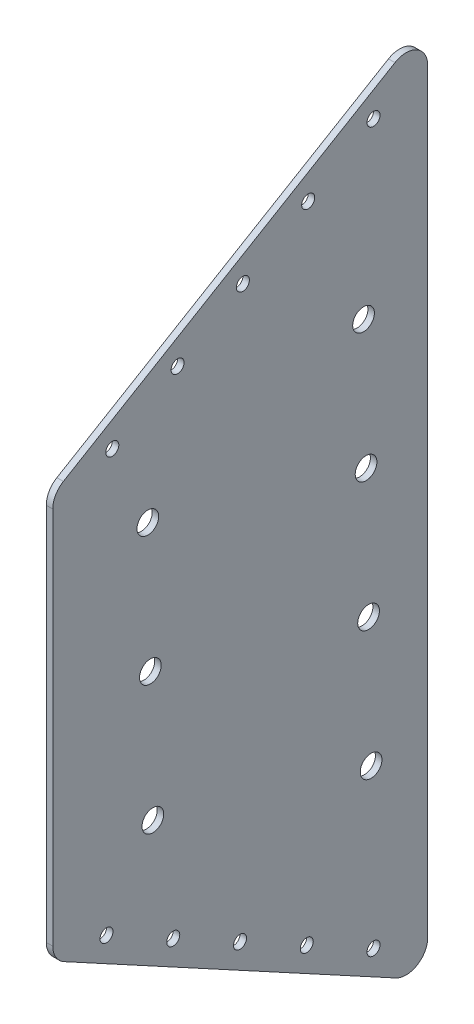
ISO-10303-21;
HEADER;
FILE_DESCRIPTION(('STEP AP214'),'2;1');
FILE_NAME('part.step','',(''),(''),'','','');
FILE_SCHEMA(('AUTOMOTIVE_DESIGN { 1 0 10303 214 1 1 1 1 }'));
ENDSEC;
DATA;
#1=APPLICATION_CONTEXT('core data for automotive mechanical design processes');
#2=APPLICATION_PROTOCOL_DEFINITION('international standard','automotive_design',2000,#1);
#3=PRODUCT_CONTEXT('',#1,'mechanical');
#4=PRODUCT('Part','Part','',(#3));
#5=PRODUCT_RELATED_PRODUCT_CATEGORY('part','',(#4));
#6=PRODUCT_DEFINITION_FORMATION('','',#4);
#7=PRODUCT_DEFINITION_CONTEXT('part definition',#1,'design');
#8=PRODUCT_DEFINITION('design','',#6,#7);
#9=PRODUCT_DEFINITION_SHAPE('','',#8);
#10=(LENGTH_UNIT() NAMED_UNIT(*) SI_UNIT(.MILLI.,.METRE.));
#11=(NAMED_UNIT(*) PLANE_ANGLE_UNIT() SI_UNIT($,.RADIAN.));
#12=(NAMED_UNIT(*) SI_UNIT($,.STERADIAN.) SOLID_ANGLE_UNIT());
#13=UNCERTAINTY_MEASURE_WITH_UNIT(LENGTH_MEASURE(1.E-05),#10,'distance_accuracy_value','');
#14=(GEOMETRIC_REPRESENTATION_CONTEXT(3) GLOBAL_UNCERTAINTY_ASSIGNED_CONTEXT((#13)) GLOBAL_UNIT_ASSIGNED_CONTEXT((#10,
#11,#12)) REPRESENTATION_CONTEXT('',''));
#15=CARTESIAN_POINT('',(0.,0.,0.));
#16=DIRECTION('',(0.,0.,1.));
#17=DIRECTION('',(1.,0.,0.));
#18=AXIS2_PLACEMENT_3D('',#15,#16,#17);
#19=CARTESIAN_POINT('',(3.,317.945389167895,-631.946459814717));
#20=DIRECTION('',(0.,0.8789083603278,-0.476990664631812));
#21=DIRECTION('',(0.,0.476990664631812,0.8789083603278));
#22=AXIS2_PLACEMENT_3D('',#19,#20,#21);
#23=PLANE('',#22);
#24=DIRECTION('',(0.,-0.476990664631812,-0.8789083603278));
#25=VECTOR('',#24,1.);
#26=CARTESIAN_POINT('',(3.,317.945389167895,-631.946459814717));
#27=LINE('',#26,#25);
#28=CARTESIAN_POINT('',(3.,408.895308586337,-464.36111595959));
#29=VERTEX_POINT('',#28);
#30=CARTESIAN_POINT('',(3.,325.961136776838,-617.176553168399));
#31=VERTEX_POINT('',#30);
#32=EDGE_CURVE('E127',#29,#31,#27,.T.);
#33=ORIENTED_EDGE('',*,*,#32,.F.);
#34=DIRECTION('',(-1.,0.,0.));
#35=VECTOR('',#34,1.);
#36=CARTESIAN_POINT('',(3.,408.895308586337,-464.361115959591));
#37=LINE('',#36,#35);
#38=CARTESIAN_POINT('',(0.,408.895308586337,-464.36111595959));
#39=VERTEX_POINT('',#38);
#40=EDGE_CURVE('E153',#29,#39,#37,.T.);
#41=ORIENTED_EDGE('',*,*,#40,.T.);
#42=DIRECTION('',(0.,-0.476990664631812,-0.8789083603278));
#43=VECTOR('',#42,1.);
#44=CARTESIAN_POINT('',(0.,317.945389167895,-631.946459814717));
#45=LINE('',#44,#43);
#46=CARTESIAN_POINT('',(0.,325.961136776838,-617.176553168399));
#47=VERTEX_POINT('',#46);
#48=EDGE_CURVE('E159',#39,#47,#45,.T.);
#49=ORIENTED_EDGE('',*,*,#48,.T.);
#50=DIRECTION('',(-1.,0.,0.));
#51=VECTOR('',#50,1.);
#52=CARTESIAN_POINT('',(3.,325.961136776838,-617.176553168399));
#53=LINE('',#52,#51);
#54=EDGE_CURVE('E151',#47,#31,#53,.F.);
#55=ORIENTED_EDGE('',*,*,#54,.T.);
#56=EDGE_LOOP('',(#33,#41,#49,#55));
#57=FACE_BOUND('',#56,.T.);
#58=ADVANCED_FACE('F35',(#57),#23,.F.);
#59=CARTESIAN_POINT('',(3.,700.452034156903,-631.946459814717));
#60=DIRECTION('',(0.,0.,1.));
#61=DIRECTION('',(1.,0.,0.));
#62=AXIS2_PLACEMENT_3D('',#59,#60,#61);
#63=PLANE('',#62);
#64=DIRECTION('',(0.,1.,0.));
#65=VECTOR('',#64,1.);
#66=CARTESIAN_POINT('',(3.,700.452034156903,-631.946459814717));
#67=LINE('',#66,#65);
#68=CARTESIAN_POINT('',(3.,334.750220380116,-631.946459814717));
#69=VERTEX_POINT('',#68);
#70=CARTESIAN_POINT('',(3.,682.885243210379,-631.946459814717));
#71=VERTEX_POINT('',#70);
#72=EDGE_CURVE('E130',#69,#71,#67,.T.);
#73=ORIENTED_EDGE('',*,*,#72,.F.);
#74=DIRECTION('',(-1.,0.,0.));
#75=VECTOR('',#74,1.);
#76=CARTESIAN_POINT('',(3.,334.750220380116,-631.946459814717));
#77=LINE('',#76,#75);
#78=CARTESIAN_POINT('',(0.,334.750220380116,-631.946459814717));
#79=VERTEX_POINT('',#78);
#80=EDGE_CURVE('E11',#69,#79,#77,.T.);
#81=ORIENTED_EDGE('',*,*,#80,.T.);
#82=DIRECTION('',(0.,1.,0.));
#83=VECTOR('',#82,1.);
#84=CARTESIAN_POINT('',(0.,700.452034156903,-631.946459814717));
#85=LINE('',#84,#83);
#86=CARTESIAN_POINT('',(0.,682.885243210379,-631.946459814717));
#87=VERTEX_POINT('',#86);
#88=EDGE_CURVE('E132',#79,#87,#85,.T.);
#89=ORIENTED_EDGE('',*,*,#88,.T.);
#90=DIRECTION('',(-1.,0.,0.));
#91=VECTOR('',#90,1.);
#92=CARTESIAN_POINT('',(3.,682.885243210379,-631.946459814717));
#93=LINE('',#92,#91);
#94=EDGE_CURVE('E43',#87,#71,#93,.F.);
#95=ORIENTED_EDGE('',*,*,#94,.T.);
#96=EDGE_LOOP('',(#73,#81,#89,#95));
#97=FACE_BOUND('',#96,.T.);
#98=ADVANCED_FACE('F317',(#97),#63,.F.);
#99=CARTESIAN_POINT('',(3.,597.849507887663,-459.131022605909));
#100=DIRECTION('',(0.,-0.859869246027072,-0.510514328630289));
#101=DIRECTION('',(0.,0.510514328630289,-0.859869246027072));
#102=AXIS2_PLACEMENT_3D('',#99,#100,#101);
#103=PLANE('',#102);
#104=DIRECTION('',(0.,-0.510514328630289,0.859869246027072));
#105=VECTOR('',#104,1.);
#106=CARTESIAN_POINT('',(0.,597.849507887663,-459.131022605909));
#107=LINE('',#106,#105);
#108=CARTESIAN_POINT('',(0.,691.48393567065,-616.841316528414));
#109=VERTEX_POINT('',#108);
#110=CARTESIAN_POINT('',(0.,600.755641000901,-464.025879319606));
#111=VERTEX_POINT('',#110);
#112=EDGE_CURVE('E128',#109,#111,#107,.T.);
#113=ORIENTED_EDGE('',*,*,#112,.T.);
#114=DIRECTION('',(-1.,0.,0.));
#115=VECTOR('',#114,1.);
#116=CARTESIAN_POINT('',(3.,600.755641000901,-464.025879319606));
#117=LINE('',#116,#115);
#118=CARTESIAN_POINT('',(3.,600.755641000901,-464.025879319606));
#119=VERTEX_POINT('',#118);
#120=EDGE_CURVE('E106',#111,#119,#117,.F.);
#121=ORIENTED_EDGE('',*,*,#120,.T.);
#122=DIRECTION('',(0.,-0.510514328630289,0.859869246027072));
#123=VECTOR('',#122,1.);
#124=CARTESIAN_POINT('',(3.,597.849507887663,-459.131022605909));
#125=LINE('',#124,#123);
#126=CARTESIAN_POINT('',(3.,691.48393567065,-616.841316528414));
#127=VERTEX_POINT('',#126);
#128=EDGE_CURVE('E171',#127,#119,#125,.T.);
#129=ORIENTED_EDGE('',*,*,#128,.F.);
#130=DIRECTION('',(-1.,0.,0.));
#131=VECTOR('',#130,1.);
#132=CARTESIAN_POINT('',(3.,691.48393567065,-616.841316528414));
#133=LINE('',#132,#131);
#134=EDGE_CURVE('E111',#127,#109,#133,.T.);
#135=ORIENTED_EDGE('',*,*,#134,.T.);
#136=EDGE_LOOP('',(#113,#121,#129,#135));
#137=FACE_BOUND('',#136,.T.);
#138=ADVANCED_FACE('F315',(#137),#103,.F.);
#139=CARTESIAN_POINT('',(3.,411.73372248415,-459.131022605909));
#140=DIRECTION('',(0.,0.,-1.));
#141=DIRECTION('',(-1.,0.,0.));
#142=AXIS2_PLACEMENT_3D('',#139,#140,#141);
#143=PLANE('',#142);
#144=DIRECTION('',(0.,-1.,0.));
#145=VECTOR('',#144,1.);
#146=CARTESIAN_POINT('',(3.,411.73372248415,-459.131022605909));
#147=LINE('',#146,#145);
#148=CARTESIAN_POINT('',(3.,592.15694854063,-459.131022605909));
#149=VERTEX_POINT('',#148);
#150=CARTESIAN_POINT('',(3.,417.684392189615,-459.131022605909));
#151=VERTEX_POINT('',#150);
#152=EDGE_CURVE('E121',#149,#151,#147,.T.);
#153=ORIENTED_EDGE('',*,*,#152,.F.);
#154=DIRECTION('',(-1.,0.,0.));
#155=VECTOR('',#154,1.);
#156=CARTESIAN_POINT('',(3.,592.15694854063,-459.131022605909));
#157=LINE('',#156,#155);
#158=CARTESIAN_POINT('',(0.,592.15694854063,-459.131022605909));
#159=VERTEX_POINT('',#158);
#160=EDGE_CURVE('E105',#149,#159,#157,.T.);
#161=ORIENTED_EDGE('',*,*,#160,.T.);
#162=DIRECTION('',(0.,-1.,0.));
#163=VECTOR('',#162,1.);
#164=CARTESIAN_POINT('',(0.,411.73372248415,-459.131022605909));
#165=LINE('',#164,#163);
#166=CARTESIAN_POINT('',(0.,417.684392189615,-459.131022605909));
#167=VERTEX_POINT('',#166);
#168=EDGE_CURVE('E118',#159,#167,#165,.T.);
#169=ORIENTED_EDGE('',*,*,#168,.T.);
#170=DIRECTION('',(-1.,0.,0.));
#171=VECTOR('',#170,1.);
#172=CARTESIAN_POINT('',(3.,417.684392189615,-459.131022605909));
#173=LINE('',#172,#171);
#174=EDGE_CURVE('E123',#167,#151,#173,.F.);
#175=ORIENTED_EDGE('',*,*,#174,.T.);
#176=EDGE_LOOP('',(#153,#161,#169,#175));
#177=FACE_BOUND('',#176,.T.);
#178=ADVANCED_FACE('F117',(#177),#143,.F.);
#179=CARTESIAN_POINT('',(3.,0.,0.));
#180=DIRECTION('',(-1.,0.,0.));
#181=DIRECTION('',(0.,0.,1.));
#182=AXIS2_PLACEMENT_3D('',#179,#180,#181);
#183=PLANE('',#182);
#184=CARTESIAN_POINT('',(3.,536.299523654884,-603.522472038288));
#185=DIRECTION('',(1.,0.,0.));
#186=DIRECTION('',(0.,0.,-1.));
#187=AXIS2_PLACEMENT_3D('',#184,#185,#186);
#188=CIRCLE('',#187,5.00000000000005);
#189=CARTESIAN_POINT('',(3.,536.299523654884,-608.522472038288));
#190=VERTEX_POINT('',#189);
#191=EDGE_CURVE('E235',#190,#190,#188,.T.);
#192=ORIENTED_EDGE('',*,*,#191,.F.);
#193=EDGE_LOOP('',(#192));
#194=FACE_BOUND('',#193,.T.);
#195=CARTESIAN_POINT('',(3.,476.310683396387,-604.679642916149));
#196=DIRECTION('',(1.,0.,0.));
#197=DIRECTION('',(0.,0.,-1.));
#198=AXIS2_PLACEMENT_3D('',#195,#196,#197);
#199=CIRCLE('',#198,5.00000000000005);
#200=CARTESIAN_POINT('',(3.,476.310683396387,-609.679642916149));
#201=VERTEX_POINT('',#200);
#202=EDGE_CURVE('E265',#201,#201,#199,.T.);
#203=ORIENTED_EDGE('',*,*,#202,.F.);
#204=EDGE_LOOP('',(#203));
#205=FACE_BOUND('',#204,.T.);
#206=CARTESIAN_POINT('',(3.,416.32184313789,-605.836813794009));
#207=DIRECTION('',(1.,0.,0.));
#208=DIRECTION('',(0.,0.,-1.));
#209=AXIS2_PLACEMENT_3D('',#206,#207,#208);
#210=CIRCLE('',#209,5.00000000000005);
#211=CARTESIAN_POINT('',(3.,416.32184313789,-610.836813794009));
#212=VERTEX_POINT('',#211);
#213=EDGE_CURVE('E259',#212,#212,#210,.T.);
#214=ORIENTED_EDGE('',*,*,#213,.F.);
#215=EDGE_LOOP('',(#214));
#216=FACE_BOUND('',#215,.T.);
#217=CARTESIAN_POINT('',(3.,564.856704632131,-502.953007581503));
#218=DIRECTION('',(1.,0.,0.));
#219=DIRECTION('',(0.,0.,-1.));
#220=AXIS2_PLACEMENT_3D('',#217,#218,#219);
#221=CIRCLE('',#220,5.00000000000005);
#222=CARTESIAN_POINT('',(3.,564.856704632131,-507.953007581503));
#223=VERTEX_POINT('',#222);
#224=EDGE_CURVE('E253',#223,#223,#221,.T.);
#225=ORIENTED_EDGE('',*,*,#224,.F.);
#226=EDGE_LOOP('',(#225));
#227=FACE_BOUND('',#226,.T.);
#228=CARTESIAN_POINT('',(3.,504.867864373634,-504.110178459364));
#229=DIRECTION('',(1.,0.,0.));
#230=DIRECTION('',(0.,0.,-1.));
#231=AXIS2_PLACEMENT_3D('',#228,#229,#230);
#232=CIRCLE('',#231,5.00000000000005);
#233=CARTESIAN_POINT('',(3.,504.867864373634,-509.110178459364));
#234=VERTEX_POINT('',#233);
#235=EDGE_CURVE('E247',#234,#234,#232,.T.);
#236=ORIENTED_EDGE('',*,*,#235,.F.);
#237=EDGE_LOOP('',(#236));
#238=FACE_BOUND('',#237,.T.);
#239=CARTESIAN_POINT('',(3.,444.879024115137,-505.267349337224));
#240=DIRECTION('',(1.,0.,0.));
#241=DIRECTION('',(0.,0.,-1.));
#242=AXIS2_PLACEMENT_3D('',#239,#240,#241);
#243=CIRCLE('',#242,4.99999999999992);
#244=CARTESIAN_POINT('',(3.,444.879024115137,-510.267349337224));
#245=VERTEX_POINT('',#244);
#246=EDGE_CURVE('E241',#245,#245,#243,.T.);
#247=ORIENTED_EDGE('',*,*,#246,.F.);
#248=EDGE_LOOP('',(#247));
#249=FACE_BOUND('',#248,.T.);
#250=CARTESIAN_POINT('',(3.,596.288363913381,-602.365301160428));
#251=DIRECTION('',(1.,0.,0.));
#252=DIRECTION('',(0.,0.,-1.));
#253=AXIS2_PLACEMENT_3D('',#250,#251,#252);
#254=CIRCLE('',#253,4.99999999999994);
#255=CARTESIAN_POINT('',(3.,596.288363913381,-607.365301160428));
#256=VERTEX_POINT('',#255);
#257=EDGE_CURVE('E218',#256,#256,#254,.T.);
#258=ORIENTED_EDGE('',*,*,#257,.F.);
#259=EDGE_LOOP('',(#258));
#260=FACE_BOUND('',#259,.T.);
#261=CARTESIAN_POINT('',(3.,359.585514772297,-576.184667203244));
#262=DIRECTION('',(1.,0.,0.));
#263=DIRECTION('',(0.,0.,-1.));
#264=AXIS2_PLACEMENT_3D('',#261,#262,#263);
#265=CIRCLE('',#264,3.00000000000005);
#266=CARTESIAN_POINT('',(3.,359.585514772297,-579.184667203244));
#267=VERTEX_POINT('',#266);
#268=EDGE_CURVE('E182',#267,#267,#265,.T.);
#269=ORIENTED_EDGE('',*,*,#268,.F.);
#270=EDGE_LOOP('',(#269));
#271=FACE_BOUND('',#270,.T.);
#272=CARTESIAN_POINT('',(3.,602.50756350252,-486.564765370927));
#273=DIRECTION('',(1.,0.,0.));
#274=DIRECTION('',(0.,0.,-1.));
#275=AXIS2_PLACEMENT_3D('',#272,#273,#274);
#276=CIRCLE('',#275,2.99999999999999);
#277=CARTESIAN_POINT('',(3.,602.50756350252,-489.564765370927));
#278=VERTEX_POINT('',#277);
#279=EDGE_CURVE('E205',#278,#278,#276,.T.);
#280=ORIENTED_EDGE('',*,*,#279,.F.);
#281=EDGE_LOOP('',(#280));
#282=FACE_BOUND('',#281,.T.);
#283=CARTESIAN_POINT('',(3.,673.979569510761,-606.946459814717));
#284=DIRECTION('',(1.,0.,0.));
#285=DIRECTION('',(0.,0.,-1.));
#286=AXIS2_PLACEMENT_3D('',#283,#284,#285);
#287=CIRCLE('',#286,3.00000000000005);
#288=CARTESIAN_POINT('',(3.,673.979569510761,-609.946459814717));
#289=VERTEX_POINT('',#288);
#290=EDGE_CURVE('E206',#289,#289,#287,.T.);
#291=ORIENTED_EDGE('',*,*,#290,.F.);
#292=EDGE_LOOP('',(#291));
#293=FACE_BOUND('',#292,.T.);
#294=CARTESIAN_POINT('',(3.,409.669534558637,-483.899289368825));
#295=DIRECTION('',(1.,0.,0.));
#296=DIRECTION('',(0.,0.,-1.));
#297=AXIS2_PLACEMENT_3D('',#294,#295,#296);
#298=CIRCLE('',#297,2.99999999999999);
#299=CARTESIAN_POINT('',(3.,409.669534558637,-486.899289368825));
#300=VERTEX_POINT('',#299);
#301=EDGE_CURVE('E224',#300,#300,#298,.T.);
#302=ORIENTED_EDGE('',*,*,#301,.F.);
#303=EDGE_LOOP('',(#302));
#304=FACE_BOUND('',#303,.T.);
#305=CARTESIAN_POINT('',(3.,342.890841510183,-606.946459814717));
#306=DIRECTION('',(1.,0.,0.));
#307=DIRECTION('',(0.,0.,-1.));
#308=AXIS2_PLACEMENT_3D('',#305,#306,#307);
#309=CIRCLE('',#308,3.00000000000005);
#310=CARTESIAN_POINT('',(3.,342.890841510183,-609.946459814717));
#311=VERTEX_POINT('',#310);
#312=EDGE_CURVE('E217',#311,#311,#309,.T.);
#313=ORIENTED_EDGE('',*,*,#312,.F.);
#314=EDGE_LOOP('',(#313));
#315=FACE_BOUND('',#314,.T.);
#316=CARTESIAN_POINT('',(3.,376.28018803441,-545.422874591771));
#317=DIRECTION('',(1.,0.,0.));
#318=DIRECTION('',(0.,0.,-1.));
#319=AXIS2_PLACEMENT_3D('',#316,#317,#318);
#320=CIRCLE('',#319,3.00000000000005);
#321=CARTESIAN_POINT('',(3.,376.28018803441,-548.422874591771));
#322=VERTEX_POINT('',#321);
#323=EDGE_CURVE('E181',#322,#322,#320,.T.);
#324=ORIENTED_EDGE('',*,*,#323,.F.);
#325=EDGE_LOOP('',(#324));
#326=FACE_BOUND('',#325,.T.);
#327=CARTESIAN_POINT('',(3.,392.974861296524,-514.661081980298));
#328=DIRECTION('',(1.,0.,0.));
#329=DIRECTION('',(0.,0.,-1.));
#330=AXIS2_PLACEMENT_3D('',#327,#328,#329);
#331=CIRCLE('',#330,3.00000000000005);
#332=CARTESIAN_POINT('',(3.,392.974861296524,-517.661081980298));
#333=VERTEX_POINT('',#332);
#334=EDGE_CURVE('E188',#333,#333,#331,.T.);
#335=ORIENTED_EDGE('',*,*,#334,.F.);
#336=EDGE_LOOP('',(#335));
#337=FACE_BOUND('',#336,.T.);
#338=CARTESIAN_POINT('',(3.,656.1115680087,-576.85103620377));
#339=DIRECTION('',(1.,0.,0.));
#340=DIRECTION('',(0.,0.,-1.));
#341=AXIS2_PLACEMENT_3D('',#338,#339,#340);
#342=CIRCLE('',#341,3.00000000000005);
#343=CARTESIAN_POINT('',(3.,656.1115680087,-579.85103620377));
#344=VERTEX_POINT('',#343);
#345=EDGE_CURVE('E194',#344,#344,#342,.T.);
#346=ORIENTED_EDGE('',*,*,#345,.F.);
#347=EDGE_LOOP('',(#346));
#348=FACE_BOUND('',#347,.T.);
#349=CARTESIAN_POINT('',(3.,638.24356650664,-546.755612592822));
#350=DIRECTION('',(1.,0.,0.));
#351=DIRECTION('',(0.,0.,-1.));
#352=AXIS2_PLACEMENT_3D('',#349,#350,#351);
#353=CIRCLE('',#352,3.00000000000005);
#354=CARTESIAN_POINT('',(3.,638.24356650664,-549.755612592822));
#355=VERTEX_POINT('',#354);
#356=EDGE_CURVE('E176',#355,#355,#353,.T.);
#357=ORIENTED_EDGE('',*,*,#356,.F.);
#358=EDGE_LOOP('',(#357));
#359=FACE_BOUND('',#358,.T.);
#360=CARTESIAN_POINT('',(3.,620.37556500458,-516.660188981875));
#361=DIRECTION('',(1.,0.,0.));
#362=DIRECTION('',(0.,0.,-1.));
#363=AXIS2_PLACEMENT_3D('',#360,#361,#362);
#364=CIRCLE('',#363,3.00000000000005);
#365=CARTESIAN_POINT('',(3.,620.37556500458,-519.660188981875));
#366=VERTEX_POINT('',#365);
#367=EDGE_CURVE('E164',#366,#366,#364,.T.);
#368=ORIENTED_EDGE('',*,*,#367,.F.);
#369=EDGE_LOOP('',(#368));
#370=FACE_BOUND('',#369,.T.);
#371=ORIENTED_EDGE('',*,*,#128,.T.);
#372=CARTESIAN_POINT('',(3.,592.15694854063,-469.131022605909));
#373=DIRECTION('',(-1.,0.,0.));
#374=DIRECTION('',(0.,0.,1.));
#375=AXIS2_PLACEMENT_3D('',#372,#373,#374);
#376=CIRCLE('',#375,10.);
#377=EDGE_CURVE('E149',#119,#149,#376,.F.);
#378=ORIENTED_EDGE('',*,*,#377,.T.);
#379=ORIENTED_EDGE('',*,*,#152,.T.);
#380=CARTESIAN_POINT('',(3.,417.684392189615,-469.131022605909));
#381=DIRECTION('',(-1.,0.,0.));
#382=DIRECTION('',(0.,0.,1.));
#383=AXIS2_PLACEMENT_3D('',#380,#381,#382);
#384=CIRCLE('',#383,10.);
#385=EDGE_CURVE('E147',#151,#29,#384,.F.);
#386=ORIENTED_EDGE('',*,*,#385,.T.);
#387=ORIENTED_EDGE('',*,*,#32,.T.);
#388=CARTESIAN_POINT('',(3.,334.750220380116,-621.946459814717));
#389=DIRECTION('',(-1.,0.,0.));
#390=DIRECTION('',(0.,0.,1.));
#391=AXIS2_PLACEMENT_3D('',#388,#389,#390);
#392=CIRCLE('',#391,10.);
#393=EDGE_CURVE('E56',#31,#69,#392,.F.);
#394=ORIENTED_EDGE('',*,*,#393,.T.);
#395=ORIENTED_EDGE('',*,*,#72,.T.);
#396=CARTESIAN_POINT('',(3.,682.885243210379,-621.946459814717));
#397=DIRECTION('',(-1.,0.,0.));
#398=DIRECTION('',(0.,0.,1.));
#399=AXIS2_PLACEMENT_3D('',#396,#397,#398);
#400=CIRCLE('',#399,10.);
#401=EDGE_CURVE('E144',#71,#127,#400,.F.);
#402=ORIENTED_EDGE('',*,*,#401,.T.);
#403=EDGE_LOOP('',(#371,#378,#379,#386,#387,#394,#395,#402));
#404=FACE_BOUND('',#403,.T.);
#405=ADVANCED_FACE('F276',(#194,#205,#216,#227,#238,#249,#260,#271,#282,#293,#304,#315,#326,
#337,#348,#359,#370,#404),#183,.F.);
#406=CARTESIAN_POINT('',(0.,0.,0.));
#407=DIRECTION('',(-1.,0.,0.));
#408=DIRECTION('',(0.,0.,1.));
#409=AXIS2_PLACEMENT_3D('',#406,#407,#408);
#410=PLANE('',#409);
#411=CARTESIAN_POINT('',(0.,536.299523654884,-603.522472038288));
#412=DIRECTION('',(-1.,0.,0.));
#413=DIRECTION('',(0.,0.,1.));
#414=AXIS2_PLACEMENT_3D('',#411,#412,#413);
#415=CIRCLE('',#414,5.00000000000005);
#416=CARTESIAN_POINT('',(0.,536.299523654884,-598.522472038288));
#417=VERTEX_POINT('',#416);
#418=EDGE_CURVE('E268',#417,#417,#415,.F.);
#419=ORIENTED_EDGE('',*,*,#418,.T.);
#420=EDGE_LOOP('',(#419));
#421=FACE_BOUND('',#420,.T.);
#422=CARTESIAN_POINT('',(0.,476.310683396387,-604.679642916149));
#423=DIRECTION('',(-1.,0.,0.));
#424=DIRECTION('',(0.,0.,1.));
#425=AXIS2_PLACEMENT_3D('',#422,#423,#424);
#426=CIRCLE('',#425,5.00000000000005);
#427=CARTESIAN_POINT('',(0.,476.310683396387,-599.679642916149));
#428=VERTEX_POINT('',#427);
#429=EDGE_CURVE('E262',#428,#428,#426,.F.);
#430=ORIENTED_EDGE('',*,*,#429,.T.);
#431=EDGE_LOOP('',(#430));
#432=FACE_BOUND('',#431,.T.);
#433=CARTESIAN_POINT('',(0.,416.32184313789,-605.836813794009));
#434=DIRECTION('',(-1.,0.,0.));
#435=DIRECTION('',(0.,0.,1.));
#436=AXIS2_PLACEMENT_3D('',#433,#434,#435);
#437=CIRCLE('',#436,5.00000000000005);
#438=CARTESIAN_POINT('',(0.,416.32184313789,-600.836813794009));
#439=VERTEX_POINT('',#438);
#440=EDGE_CURVE('E256',#439,#439,#437,.F.);
#441=ORIENTED_EDGE('',*,*,#440,.T.);
#442=EDGE_LOOP('',(#441));
#443=FACE_BOUND('',#442,.T.);
#444=CARTESIAN_POINT('',(0.,564.856704632131,-502.953007581503));
#445=DIRECTION('',(-1.,0.,0.));
#446=DIRECTION('',(0.,0.,1.));
#447=AXIS2_PLACEMENT_3D('',#444,#445,#446);
#448=CIRCLE('',#447,5.00000000000005);
#449=CARTESIAN_POINT('',(0.,564.856704632131,-497.953007581503));
#450=VERTEX_POINT('',#449);
#451=EDGE_CURVE('E250',#450,#450,#448,.F.);
#452=ORIENTED_EDGE('',*,*,#451,.T.);
#453=EDGE_LOOP('',(#452));
#454=FACE_BOUND('',#453,.T.);
#455=CARTESIAN_POINT('',(0.,504.867864373634,-504.110178459364));
#456=DIRECTION('',(-1.,0.,0.));
#457=DIRECTION('',(0.,0.,1.));
#458=AXIS2_PLACEMENT_3D('',#455,#456,#457);
#459=CIRCLE('',#458,5.00000000000005);
#460=CARTESIAN_POINT('',(0.,504.867864373634,-499.110178459364));
#461=VERTEX_POINT('',#460);
#462=EDGE_CURVE('E244',#461,#461,#459,.F.);
#463=ORIENTED_EDGE('',*,*,#462,.T.);
#464=EDGE_LOOP('',(#463));
#465=FACE_BOUND('',#464,.T.);
#466=CARTESIAN_POINT('',(0.,444.879024115137,-505.267349337224));
#467=DIRECTION('',(-1.,0.,0.));
#468=DIRECTION('',(0.,0.,1.));
#469=AXIS2_PLACEMENT_3D('',#466,#467,#468);
#470=CIRCLE('',#469,4.99999999999992);
#471=CARTESIAN_POINT('',(0.,444.879024115137,-500.267349337224));
#472=VERTEX_POINT('',#471);
#473=EDGE_CURVE('E238',#472,#472,#470,.F.);
#474=ORIENTED_EDGE('',*,*,#473,.T.);
#475=EDGE_LOOP('',(#474));
#476=FACE_BOUND('',#475,.T.);
#477=CARTESIAN_POINT('',(0.,596.288363913381,-602.365301160428));
#478=DIRECTION('',(-1.,0.,0.));
#479=DIRECTION('',(0.,0.,1.));
#480=AXIS2_PLACEMENT_3D('',#477,#478,#479);
#481=CIRCLE('',#480,4.99999999999994);
#482=CARTESIAN_POINT('',(0.,596.288363913381,-597.365301160428));
#483=VERTEX_POINT('',#482);
#484=EDGE_CURVE('E232',#483,#483,#481,.F.);
#485=ORIENTED_EDGE('',*,*,#484,.T.);
#486=EDGE_LOOP('',(#485));
#487=FACE_BOUND('',#486,.T.);
#488=CARTESIAN_POINT('',(0.,359.585514772297,-576.184667203244));
#489=DIRECTION('',(-1.,0.,0.));
#490=DIRECTION('',(0.,0.,1.));
#491=AXIS2_PLACEMENT_3D('',#488,#489,#490);
#492=CIRCLE('',#491,3.00000000000005);
#493=CARTESIAN_POINT('',(0.,359.585514772297,-573.184667203244));
#494=VERTEX_POINT('',#493);
#495=EDGE_CURVE('E209',#494,#494,#492,.F.);
#496=ORIENTED_EDGE('',*,*,#495,.T.);
#497=EDGE_LOOP('',(#496));
#498=FACE_BOUND('',#497,.T.);
#499=CARTESIAN_POINT('',(0.,602.50756350252,-486.564765370927));
#500=DIRECTION('',(-1.,0.,0.));
#501=DIRECTION('',(0.,0.,1.));
#502=AXIS2_PLACEMENT_3D('',#499,#500,#501);
#503=CIRCLE('',#502,2.99999999999999);
#504=CARTESIAN_POINT('',(0.,602.50756350252,-483.564765370927));
#505=VERTEX_POINT('',#504);
#506=EDGE_CURVE('E202',#505,#505,#503,.F.);
#507=ORIENTED_EDGE('',*,*,#506,.T.);
#508=EDGE_LOOP('',(#507));
#509=FACE_BOUND('',#508,.T.);
#510=CARTESIAN_POINT('',(0.,673.979569510761,-606.946459814717));
#511=DIRECTION('',(-1.,0.,0.));
#512=DIRECTION('',(0.,0.,1.));
#513=AXIS2_PLACEMENT_3D('',#510,#511,#512);
#514=CIRCLE('',#513,3.00000000000005);
#515=CARTESIAN_POINT('',(0.,673.979569510761,-603.946459814717));
#516=VERTEX_POINT('',#515);
#517=EDGE_CURVE('E227',#516,#516,#514,.F.);
#518=ORIENTED_EDGE('',*,*,#517,.T.);
#519=EDGE_LOOP('',(#518));
#520=FACE_BOUND('',#519,.T.);
#521=CARTESIAN_POINT('',(0.,409.669534558637,-483.899289368825));
#522=DIRECTION('',(-1.,0.,0.));
#523=DIRECTION('',(0.,0.,1.));
#524=AXIS2_PLACEMENT_3D('',#521,#522,#523);
#525=CIRCLE('',#524,2.99999999999999);
#526=CARTESIAN_POINT('',(0.,409.669534558637,-480.899289368825));
#527=VERTEX_POINT('',#526);
#528=EDGE_CURVE('E221',#527,#527,#525,.F.);
#529=ORIENTED_EDGE('',*,*,#528,.T.);
#530=EDGE_LOOP('',(#529));
#531=FACE_BOUND('',#530,.T.);
#532=CARTESIAN_POINT('',(0.,342.890841510183,-606.946459814717));
#533=DIRECTION('',(-1.,0.,0.));
#534=DIRECTION('',(0.,0.,1.));
#535=AXIS2_PLACEMENT_3D('',#532,#533,#534);
#536=CIRCLE('',#535,3.00000000000005);
#537=CARTESIAN_POINT('',(0.,342.890841510183,-603.946459814717));
#538=VERTEX_POINT('',#537);
#539=EDGE_CURVE('E214',#538,#538,#536,.F.);
#540=ORIENTED_EDGE('',*,*,#539,.T.);
#541=EDGE_LOOP('',(#540));
#542=FACE_BOUND('',#541,.T.);
#543=CARTESIAN_POINT('',(0.,376.28018803441,-545.422874591771));
#544=DIRECTION('',(-1.,0.,0.));
#545=DIRECTION('',(0.,0.,1.));
#546=AXIS2_PLACEMENT_3D('',#543,#544,#545);
#547=CIRCLE('',#546,3.00000000000005);
#548=CARTESIAN_POINT('',(0.,376.28018803441,-542.422874591771));
#549=VERTEX_POINT('',#548);
#550=EDGE_CURVE('E178',#549,#549,#547,.F.);
#551=ORIENTED_EDGE('',*,*,#550,.T.);
#552=EDGE_LOOP('',(#551));
#553=FACE_BOUND('',#552,.T.);
#554=CARTESIAN_POINT('',(0.,392.974861296524,-514.661081980298));
#555=DIRECTION('',(-1.,0.,0.));
#556=DIRECTION('',(0.,0.,1.));
#557=AXIS2_PLACEMENT_3D('',#554,#555,#556);
#558=CIRCLE('',#557,3.00000000000005);
#559=CARTESIAN_POINT('',(0.,392.974861296524,-511.661081980298));
#560=VERTEX_POINT('',#559);
#561=EDGE_CURVE('E185',#560,#560,#558,.F.);
#562=ORIENTED_EDGE('',*,*,#561,.T.);
#563=EDGE_LOOP('',(#562));
#564=FACE_BOUND('',#563,.T.);
#565=CARTESIAN_POINT('',(0.,656.1115680087,-576.85103620377));
#566=DIRECTION('',(-1.,0.,0.));
#567=DIRECTION('',(0.,0.,1.));
#568=AXIS2_PLACEMENT_3D('',#565,#566,#567);
#569=CIRCLE('',#568,3.00000000000005);
#570=CARTESIAN_POINT('',(0.,656.1115680087,-573.85103620377));
#571=VERTEX_POINT('',#570);
#572=EDGE_CURVE('E191',#571,#571,#569,.F.);
#573=ORIENTED_EDGE('',*,*,#572,.T.);
#574=EDGE_LOOP('',(#573));
#575=FACE_BOUND('',#574,.T.);
#576=CARTESIAN_POINT('',(0.,638.24356650664,-546.755612592822));
#577=DIRECTION('',(-1.,0.,0.));
#578=DIRECTION('',(0.,0.,1.));
#579=AXIS2_PLACEMENT_3D('',#576,#577,#578);
#580=CIRCLE('',#579,3.00000000000005);
#581=CARTESIAN_POINT('',(0.,638.24356650664,-543.755612592822));
#582=VERTEX_POINT('',#581);
#583=EDGE_CURVE('E197',#582,#582,#580,.F.);
#584=ORIENTED_EDGE('',*,*,#583,.T.);
#585=EDGE_LOOP('',(#584));
#586=FACE_BOUND('',#585,.T.);
#587=CARTESIAN_POINT('',(0.,620.37556500458,-516.660188981875));
#588=DIRECTION('',(-1.,0.,0.));
#589=DIRECTION('',(0.,0.,1.));
#590=AXIS2_PLACEMENT_3D('',#587,#588,#589);
#591=CIRCLE('',#590,3.00000000000005);
#592=CARTESIAN_POINT('',(0.,620.37556500458,-513.660188981875));
#593=VERTEX_POINT('',#592);
#594=EDGE_CURVE('E167',#593,#593,#591,.F.);
#595=ORIENTED_EDGE('',*,*,#594,.T.);
#596=EDGE_LOOP('',(#595));
#597=FACE_BOUND('',#596,.T.);
#598=ORIENTED_EDGE('',*,*,#168,.F.);
#599=CARTESIAN_POINT('',(0.,592.15694854063,-469.131022605909));
#600=DIRECTION('',(-1.,0.,0.));
#601=DIRECTION('',(0.,0.,1.));
#602=AXIS2_PLACEMENT_3D('',#599,#600,#601);
#603=CIRCLE('',#602,10.);
#604=EDGE_CURVE('E101',#159,#111,#603,.T.);
#605=ORIENTED_EDGE('',*,*,#604,.T.);
#606=ORIENTED_EDGE('',*,*,#112,.F.);
#607=CARTESIAN_POINT('',(0.,682.885243210379,-621.946459814717));
#608=DIRECTION('',(-1.,0.,0.));
#609=DIRECTION('',(0.,0.,1.));
#610=AXIS2_PLACEMENT_3D('',#607,#608,#609);
#611=CIRCLE('',#610,10.);
#612=EDGE_CURVE('E122',#109,#87,#611,.T.);
#613=ORIENTED_EDGE('',*,*,#612,.T.);
#614=ORIENTED_EDGE('',*,*,#88,.F.);
#615=CARTESIAN_POINT('',(0.,334.750220380116,-621.946459814717));
#616=DIRECTION('',(-1.,0.,0.));
#617=DIRECTION('',(0.,0.,1.));
#618=AXIS2_PLACEMENT_3D('',#615,#616,#617);
#619=CIRCLE('',#618,10.);
#620=EDGE_CURVE('E138',#79,#47,#619,.T.);
#621=ORIENTED_EDGE('',*,*,#620,.T.);
#622=ORIENTED_EDGE('',*,*,#48,.F.);
#623=CARTESIAN_POINT('',(0.,417.684392189615,-469.131022605909));
#624=DIRECTION('',(-1.,0.,0.));
#625=DIRECTION('',(0.,0.,1.));
#626=AXIS2_PLACEMENT_3D('',#623,#624,#625);
#627=CIRCLE('',#626,10.);
#628=EDGE_CURVE('E112',#39,#167,#627,.T.);
#629=ORIENTED_EDGE('',*,*,#628,.T.);
#630=EDGE_LOOP('',(#598,#605,#606,#613,#614,#621,#622,#629));
#631=FACE_BOUND('',#630,.T.);
#632=ADVANCED_FACE('F125',(#421,#432,#443,#454,#465,#476,#487,#498,#509,#520,#531,#542,#553,
#564,#575,#586,#597,#631),#410,.T.);
#633=CARTESIAN_POINT('',(-0.00100000000000013,620.37556500458,-516.660188981875));
#634=DIRECTION('',(1.,0.,0.));
#635=DIRECTION('',(0.,0.,-1.));
#636=AXIS2_PLACEMENT_3D('',#633,#634,#635);
#637=CYLINDRICAL_SURFACE('',#636,3.00000000000005);
#638=ORIENTED_EDGE('',*,*,#594,.F.);
#639=EDGE_LOOP('',(#638));
#640=FACE_BOUND('',#639,.T.);
#641=ORIENTED_EDGE('',*,*,#367,.T.);
#642=EDGE_LOOP('',(#641));
#643=FACE_BOUND('',#642,.T.);
#644=ADVANCED_FACE('F341',(#640,#643),#637,.F.);
#645=CARTESIAN_POINT('',(-0.00100000000000013,638.24356650664,-546.755612592822));
#646=DIRECTION('',(1.,0.,0.));
#647=DIRECTION('',(0.,0.,-1.));
#648=AXIS2_PLACEMENT_3D('',#645,#646,#647);
#649=CYLINDRICAL_SURFACE('',#648,3.00000000000005);
#650=ORIENTED_EDGE('',*,*,#583,.F.);
#651=EDGE_LOOP('',(#650));
#652=FACE_BOUND('',#651,.T.);
#653=ORIENTED_EDGE('',*,*,#356,.T.);
#654=EDGE_LOOP('',(#653));
#655=FACE_BOUND('',#654,.T.);
#656=ADVANCED_FACE('F346',(#652,#655),#649,.F.);
#657=CARTESIAN_POINT('',(-0.00100000000000013,656.1115680087,-576.85103620377));
#658=DIRECTION('',(1.,0.,0.));
#659=DIRECTION('',(0.,0.,-1.));
#660=AXIS2_PLACEMENT_3D('',#657,#658,#659);
#661=CYLINDRICAL_SURFACE('',#660,3.00000000000005);
#662=ORIENTED_EDGE('',*,*,#572,.F.);
#663=EDGE_LOOP('',(#662));
#664=FACE_BOUND('',#663,.T.);
#665=ORIENTED_EDGE('',*,*,#345,.T.);
#666=EDGE_LOOP('',(#665));
#667=FACE_BOUND('',#666,.T.);
#668=ADVANCED_FACE('F356',(#664,#667),#661,.F.);
#669=CARTESIAN_POINT('',(-0.00100000000000013,392.974861296524,-514.661081980298));
#670=DIRECTION('',(1.,0.,0.));
#671=DIRECTION('',(0.,0.,-1.));
#672=AXIS2_PLACEMENT_3D('',#669,#670,#671);
#673=CYLINDRICAL_SURFACE('',#672,3.00000000000005);
#674=ORIENTED_EDGE('',*,*,#561,.F.);
#675=EDGE_LOOP('',(#674));
#676=FACE_BOUND('',#675,.T.);
#677=ORIENTED_EDGE('',*,*,#334,.T.);
#678=EDGE_LOOP('',(#677));
#679=FACE_BOUND('',#678,.T.);
#680=ADVANCED_FACE('F352',(#676,#679),#673,.F.);
#681=CARTESIAN_POINT('',(-0.00100000000000013,376.28018803441,-545.422874591771));
#682=DIRECTION('',(1.,0.,0.));
#683=DIRECTION('',(0.,0.,-1.));
#684=AXIS2_PLACEMENT_3D('',#681,#682,#683);
#685=CYLINDRICAL_SURFACE('',#684,3.00000000000005);
#686=ORIENTED_EDGE('',*,*,#550,.F.);
#687=EDGE_LOOP('',(#686));
#688=FACE_BOUND('',#687,.T.);
#689=ORIENTED_EDGE('',*,*,#323,.T.);
#690=EDGE_LOOP('',(#689));
#691=FACE_BOUND('',#690,.T.);
#692=ADVANCED_FACE('F348',(#688,#691),#685,.F.);
#693=CARTESIAN_POINT('',(-0.00100000000000013,342.890841510183,-606.946459814717));
#694=DIRECTION('',(1.,0.,0.));
#695=DIRECTION('',(0.,0.,-1.));
#696=AXIS2_PLACEMENT_3D('',#693,#694,#695);
#697=CYLINDRICAL_SURFACE('',#696,3.00000000000005);
#698=ORIENTED_EDGE('',*,*,#539,.F.);
#699=EDGE_LOOP('',(#698));
#700=FACE_BOUND('',#699,.T.);
#701=ORIENTED_EDGE('',*,*,#312,.T.);
#702=EDGE_LOOP('',(#701));
#703=FACE_BOUND('',#702,.T.);
#704=ADVANCED_FACE('F351',(#700,#703),#697,.F.);
#705=CARTESIAN_POINT('',(-0.00100000000000013,409.669534558637,-483.899289368825));
#706=DIRECTION('',(1.,0.,0.));
#707=DIRECTION('',(0.,0.,-1.));
#708=AXIS2_PLACEMENT_3D('',#705,#706,#707);
#709=CYLINDRICAL_SURFACE('',#708,2.99999999999999);
#710=ORIENTED_EDGE('',*,*,#528,.F.);
#711=EDGE_LOOP('',(#710));
#712=FACE_BOUND('',#711,.T.);
#713=ORIENTED_EDGE('',*,*,#301,.T.);
#714=EDGE_LOOP('',(#713));
#715=FACE_BOUND('',#714,.T.);
#716=ADVANCED_FACE('F376',(#712,#715),#709,.F.);
#717=CARTESIAN_POINT('',(-0.00100000000000013,673.979569510761,-606.946459814717));
#718=DIRECTION('',(1.,0.,0.));
#719=DIRECTION('',(0.,0.,-1.));
#720=AXIS2_PLACEMENT_3D('',#717,#718,#719);
#721=CYLINDRICAL_SURFACE('',#720,3.00000000000005);
#722=ORIENTED_EDGE('',*,*,#517,.F.);
#723=EDGE_LOOP('',(#722));
#724=FACE_BOUND('',#723,.T.);
#725=ORIENTED_EDGE('',*,*,#290,.T.);
#726=EDGE_LOOP('',(#725));
#727=FACE_BOUND('',#726,.T.);
#728=ADVANCED_FACE('F368',(#724,#727),#721,.F.);
#729=CARTESIAN_POINT('',(-0.00100000000000013,602.50756350252,-486.564765370927));
#730=DIRECTION('',(1.,0.,0.));
#731=DIRECTION('',(0.,0.,-1.));
#732=AXIS2_PLACEMENT_3D('',#729,#730,#731);
#733=CYLINDRICAL_SURFACE('',#732,2.99999999999999);
#734=ORIENTED_EDGE('',*,*,#506,.F.);
#735=EDGE_LOOP('',(#734));
#736=FACE_BOUND('',#735,.T.);
#737=ORIENTED_EDGE('',*,*,#279,.T.);
#738=EDGE_LOOP('',(#737));
#739=FACE_BOUND('',#738,.T.);
#740=ADVANCED_FACE('F364',(#736,#739),#733,.F.);
#741=CARTESIAN_POINT('',(-0.00100000000000013,359.585514772297,-576.184667203244));
#742=DIRECTION('',(1.,0.,0.));
#743=DIRECTION('',(0.,0.,-1.));
#744=AXIS2_PLACEMENT_3D('',#741,#742,#743);
#745=CYLINDRICAL_SURFACE('',#744,3.00000000000005);
#746=ORIENTED_EDGE('',*,*,#495,.F.);
#747=EDGE_LOOP('',(#746));
#748=FACE_BOUND('',#747,.T.);
#749=ORIENTED_EDGE('',*,*,#268,.T.);
#750=EDGE_LOOP('',(#749));
#751=FACE_BOUND('',#750,.T.);
#752=ADVANCED_FACE('F367',(#748,#751),#745,.F.);
#753=CARTESIAN_POINT('',(-0.00100000000000013,596.288363913381,-602.365301160428));
#754=DIRECTION('',(1.,0.,0.));
#755=DIRECTION('',(0.,0.,-1.));
#756=AXIS2_PLACEMENT_3D('',#753,#754,#755);
#757=CYLINDRICAL_SURFACE('',#756,4.99999999999994);
#758=ORIENTED_EDGE('',*,*,#484,.F.);
#759=EDGE_LOOP('',(#758));
#760=FACE_BOUND('',#759,.T.);
#761=ORIENTED_EDGE('',*,*,#257,.T.);
#762=EDGE_LOOP('',(#761));
#763=FACE_BOUND('',#762,.T.);
#764=ADVANCED_FACE('F372',(#760,#763),#757,.F.);
#765=CARTESIAN_POINT('',(-0.00100000000000013,444.879024115137,-505.267349337224));
#766=DIRECTION('',(1.,0.,0.));
#767=DIRECTION('',(0.,0.,-1.));
#768=AXIS2_PLACEMENT_3D('',#765,#766,#767);
#769=CYLINDRICAL_SURFACE('',#768,4.99999999999992);
#770=ORIENTED_EDGE('',*,*,#473,.F.);
#771=EDGE_LOOP('',(#770));
#772=FACE_BOUND('',#771,.T.);
#773=ORIENTED_EDGE('',*,*,#246,.T.);
#774=EDGE_LOOP('',(#773));
#775=FACE_BOUND('',#774,.T.);
#776=ADVANCED_FACE('F386',(#772,#775),#769,.F.);
#777=CARTESIAN_POINT('',(-0.00100000000000013,504.867864373634,-504.110178459364));
#778=DIRECTION('',(1.,0.,0.));
#779=DIRECTION('',(0.,0.,-1.));
#780=AXIS2_PLACEMENT_3D('',#777,#778,#779);
#781=CYLINDRICAL_SURFACE('',#780,5.00000000000005);
#782=ORIENTED_EDGE('',*,*,#462,.F.);
#783=EDGE_LOOP('',(#782));
#784=FACE_BOUND('',#783,.T.);
#785=ORIENTED_EDGE('',*,*,#235,.T.);
#786=EDGE_LOOP('',(#785));
#787=FACE_BOUND('',#786,.T.);
#788=ADVANCED_FACE('F390',(#784,#787),#781,.F.);
#789=CARTESIAN_POINT('',(-0.00100000000000013,564.856704632131,-502.953007581503));
#790=DIRECTION('',(1.,0.,0.));
#791=DIRECTION('',(0.,0.,-1.));
#792=AXIS2_PLACEMENT_3D('',#789,#790,#791);
#793=CYLINDRICAL_SURFACE('',#792,5.00000000000005);
#794=ORIENTED_EDGE('',*,*,#451,.F.);
#795=EDGE_LOOP('',(#794));
#796=FACE_BOUND('',#795,.T.);
#797=ORIENTED_EDGE('',*,*,#224,.T.);
#798=EDGE_LOOP('',(#797));
#799=FACE_BOUND('',#798,.T.);
#800=ADVANCED_FACE('F394',(#796,#799),#793,.F.);
#801=CARTESIAN_POINT('',(-0.00100000000000013,416.32184313789,-605.836813794009));
#802=DIRECTION('',(1.,0.,0.));
#803=DIRECTION('',(0.,0.,-1.));
#804=AXIS2_PLACEMENT_3D('',#801,#802,#803);
#805=CYLINDRICAL_SURFACE('',#804,5.00000000000005);
#806=ORIENTED_EDGE('',*,*,#440,.F.);
#807=EDGE_LOOP('',(#806));
#808=FACE_BOUND('',#807,.T.);
#809=ORIENTED_EDGE('',*,*,#213,.T.);
#810=EDGE_LOOP('',(#809));
#811=FACE_BOUND('',#810,.T.);
#812=ADVANCED_FACE('F398',(#808,#811),#805,.F.);
#813=CARTESIAN_POINT('',(-0.00100000000000013,476.310683396387,-604.679642916149));
#814=DIRECTION('',(1.,0.,0.));
#815=DIRECTION('',(0.,0.,-1.));
#816=AXIS2_PLACEMENT_3D('',#813,#814,#815);
#817=CYLINDRICAL_SURFACE('',#816,5.00000000000005);
#818=ORIENTED_EDGE('',*,*,#429,.F.);
#819=EDGE_LOOP('',(#818));
#820=FACE_BOUND('',#819,.T.);
#821=ORIENTED_EDGE('',*,*,#202,.T.);
#822=EDGE_LOOP('',(#821));
#823=FACE_BOUND('',#822,.T.);
#824=ADVANCED_FACE('F402',(#820,#823),#817,.F.);
#825=CARTESIAN_POINT('',(-0.00100000000000013,536.299523654884,-603.522472038288));
#826=DIRECTION('',(1.,0.,0.));
#827=DIRECTION('',(0.,0.,-1.));
#828=AXIS2_PLACEMENT_3D('',#825,#826,#827);
#829=CYLINDRICAL_SURFACE('',#828,5.00000000000005);
#830=ORIENTED_EDGE('',*,*,#418,.F.);
#831=EDGE_LOOP('',(#830));
#832=FACE_BOUND('',#831,.T.);
#833=ORIENTED_EDGE('',*,*,#191,.T.);
#834=EDGE_LOOP('',(#833));
#835=FACE_BOUND('',#834,.T.);
#836=ADVANCED_FACE('F274',(#832,#835),#829,.F.);
#837=CARTESIAN_POINT('',(3.,592.15694854063,-469.131022605909));
#838=DIRECTION('',(-1.,0.,0.));
#839=DIRECTION('',(0.,0.,1.));
#840=AXIS2_PLACEMENT_3D('',#837,#838,#839);
#841=CYLINDRICAL_SURFACE('',#840,10.);
#842=ORIENTED_EDGE('',*,*,#377,.F.);
#843=ORIENTED_EDGE('',*,*,#120,.F.);
#844=ORIENTED_EDGE('',*,*,#604,.F.);
#845=ORIENTED_EDGE('',*,*,#160,.F.);
#846=EDGE_LOOP('',(#842,#843,#844,#845));
#847=FACE_BOUND('',#846,.T.);
#848=ADVANCED_FACE('F104',(#847),#841,.T.);
#849=CARTESIAN_POINT('',(3.,417.684392189615,-469.131022605909));
#850=DIRECTION('',(-1.,0.,0.));
#851=DIRECTION('',(0.,0.,1.));
#852=AXIS2_PLACEMENT_3D('',#849,#850,#851);
#853=CYLINDRICAL_SURFACE('',#852,10.);
#854=ORIENTED_EDGE('',*,*,#385,.F.);
#855=ORIENTED_EDGE('',*,*,#174,.F.);
#856=ORIENTED_EDGE('',*,*,#628,.F.);
#857=ORIENTED_EDGE('',*,*,#40,.F.);
#858=EDGE_LOOP('',(#854,#855,#856,#857));
#859=FACE_BOUND('',#858,.T.);
#860=ADVANCED_FACE('F321',(#859),#853,.T.);
#861=CARTESIAN_POINT('',(3.,334.750220380116,-621.946459814717));
#862=DIRECTION('',(-1.,0.,0.));
#863=DIRECTION('',(0.,0.,1.));
#864=AXIS2_PLACEMENT_3D('',#861,#862,#863);
#865=CYLINDRICAL_SURFACE('',#864,10.);
#866=ORIENTED_EDGE('',*,*,#393,.F.);
#867=ORIENTED_EDGE('',*,*,#54,.F.);
#868=ORIENTED_EDGE('',*,*,#620,.F.);
#869=ORIENTED_EDGE('',*,*,#80,.F.);
#870=EDGE_LOOP('',(#866,#867,#868,#869));
#871=FACE_BOUND('',#870,.T.);
#872=ADVANCED_FACE('F320',(#871),#865,.T.);
#873=CARTESIAN_POINT('',(3.,682.885243210379,-621.946459814717));
#874=DIRECTION('',(-1.,0.,0.));
#875=DIRECTION('',(0.,0.,1.));
#876=AXIS2_PLACEMENT_3D('',#873,#874,#875);
#877=CYLINDRICAL_SURFACE('',#876,10.);
#878=ORIENTED_EDGE('',*,*,#401,.F.);
#879=ORIENTED_EDGE('',*,*,#94,.F.);
#880=ORIENTED_EDGE('',*,*,#612,.F.);
#881=ORIENTED_EDGE('',*,*,#134,.F.);
#882=EDGE_LOOP('',(#878,#879,#880,#881));
#883=FACE_BOUND('',#882,.T.);
#884=ADVANCED_FACE('F37',(#883),#877,.T.);
#885=CLOSED_SHELL('',(#58,#98,#138,#178,#405,#632,#644,#656,#668,#680,#692,#704,#716,#728,#740,
#752,#764,#776,#788,#800,#812,#824,#836,#848,#860,#872,#884));
#886=MANIFOLD_SOLID_BREP('B2',#885);
#887=ADVANCED_BREP_SHAPE_REPRESENTATION('',(#18,#886),#14);
#888=SHAPE_DEFINITION_REPRESENTATION(#9,#887);
ENDSEC;
END-ISO-10303-21;
